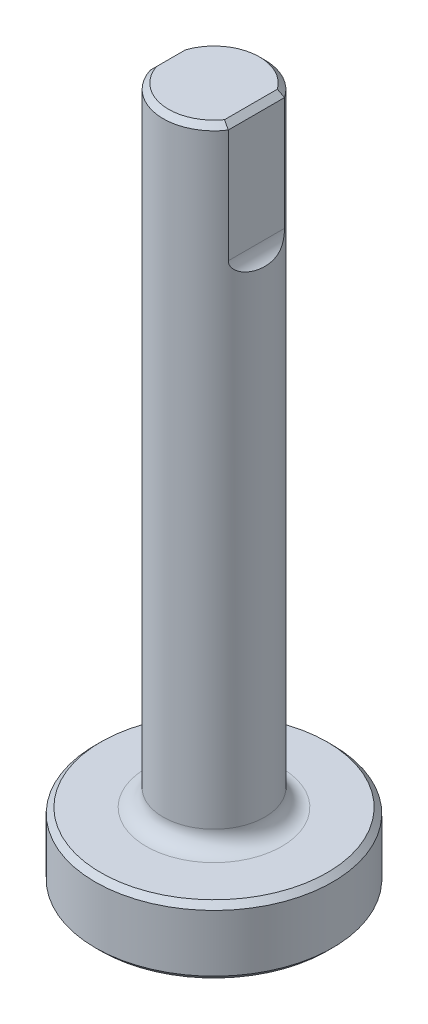
ISO-10303-21;
HEADER;
FILE_DESCRIPTION(('STEP AP214'),'2;1');
FILE_NAME('part.step','',(''),(''),'','','');
FILE_SCHEMA(('AUTOMOTIVE_DESIGN { 1 0 10303 214 1 1 1 1 }'));
ENDSEC;
DATA;
#1=APPLICATION_CONTEXT('core data for automotive mechanical design processes');
#2=APPLICATION_PROTOCOL_DEFINITION('international standard','automotive_design',2000,#1);
#3=PRODUCT_CONTEXT('',#1,'mechanical');
#4=PRODUCT('Part','Part','',(#3));
#5=PRODUCT_RELATED_PRODUCT_CATEGORY('part','',(#4));
#6=PRODUCT_DEFINITION_FORMATION('','',#4);
#7=PRODUCT_DEFINITION_CONTEXT('part definition',#1,'design');
#8=PRODUCT_DEFINITION('design','',#6,#7);
#9=PRODUCT_DEFINITION_SHAPE('','',#8);
#10=(LENGTH_UNIT() NAMED_UNIT(*) SI_UNIT(.MILLI.,.METRE.));
#11=(NAMED_UNIT(*) PLANE_ANGLE_UNIT() SI_UNIT($,.RADIAN.));
#12=(NAMED_UNIT(*) SI_UNIT($,.STERADIAN.) SOLID_ANGLE_UNIT());
#13=UNCERTAINTY_MEASURE_WITH_UNIT(LENGTH_MEASURE(1.E-05),#10,'distance_accuracy_value','');
#14=(GEOMETRIC_REPRESENTATION_CONTEXT(3) GLOBAL_UNCERTAINTY_ASSIGNED_CONTEXT((#13)) GLOBAL_UNIT_ASSIGNED_CONTEXT((#10,
#11,#12)) REPRESENTATION_CONTEXT('',''));
#15=CARTESIAN_POINT('',(0.,0.,0.));
#16=DIRECTION('',(0.,0.,1.));
#17=DIRECTION('',(1.,0.,0.));
#18=AXIS2_PLACEMENT_3D('',#15,#16,#17);
#19=CARTESIAN_POINT('',(0.,0.,0.));
#20=DIRECTION('',(0.,1.,0.));
#21=DIRECTION('',(0.,0.,1.));
#22=AXIS2_PLACEMENT_3D('',#19,#20,#21);
#23=PLANE('',#22);
#24=CARTESIAN_POINT('',(0.,0.,0.));
#25=DIRECTION('',(0.,1.,0.));
#26=DIRECTION('',(0.,0.,1.));
#27=AXIS2_PLACEMENT_3D('',#24,#25,#26);
#28=CIRCLE('',#27,5.30225);
#29=CARTESIAN_POINT('',(0.,0.,5.30225));
#30=VERTEX_POINT('',#29);
#31=EDGE_CURVE('E235',#30,#30,#28,.F.);
#32=ORIENTED_EDGE('',*,*,#31,.T.);
#33=EDGE_LOOP('',(#32));
#34=FACE_BOUND('',#33,.T.);
#35=ADVANCED_FACE('F32',(#34),#23,.F.);
#36=CARTESIAN_POINT('',(0.,3.46937086092716,0.));
#37=DIRECTION('',(0.,1.,0.));
#38=DIRECTION('',(0.,0.,1.));
#39=AXIS2_PLACEMENT_3D('',#36,#37,#38);
#40=CYLINDRICAL_SURFACE('',#39,5.55625);
#41=CARTESIAN_POINT('',(0.,0.254000000000003,0.));
#42=DIRECTION('',(0.,1.,0.));
#43=DIRECTION('',(0.,0.,1.));
#44=AXIS2_PLACEMENT_3D('',#41,#42,#43);
#45=CIRCLE('',#44,5.55625);
#46=CARTESIAN_POINT('',(0.,0.254000000000003,5.55625));
#47=VERTEX_POINT('',#46);
#48=EDGE_CURVE('E346',#47,#47,#45,.T.);
#49=ORIENTED_EDGE('',*,*,#48,.T.);
#50=EDGE_LOOP('',(#49));
#51=FACE_BOUND('',#50,.T.);
#52=CARTESIAN_POINT('',(0.,2.921,0.));
#53=DIRECTION('',(0.,-1.,0.));
#54=DIRECTION('',(0.,0.,-1.));
#55=AXIS2_PLACEMENT_3D('',#52,#53,#54);
#56=CIRCLE('',#55,5.55625);
#57=CARTESIAN_POINT('',(0.,2.921,-5.55625));
#58=VERTEX_POINT('',#57);
#59=EDGE_CURVE('E348',#58,#58,#56,.T.);
#60=ORIENTED_EDGE('',*,*,#59,.T.);
#61=EDGE_LOOP('',(#60));
#62=FACE_BOUND('',#61,.T.);
#63=ADVANCED_FACE('F184',(#51,#62),#40,.T.);
#64=CARTESIAN_POINT('',(5.55625,3.175,0.));
#65=DIRECTION('',(0.,-1.,0.));
#66=DIRECTION('',(0.,0.,-1.));
#67=AXIS2_PLACEMENT_3D('',#64,#65,#66);
#68=PLANE('',#67);
#69=CARTESIAN_POINT('',(0.,3.175,0.));
#70=DIRECTION('',(0.,-1.,0.));
#71=DIRECTION('',(0.,0.,-1.));
#72=AXIS2_PLACEMENT_3D('',#69,#70,#71);
#73=CIRCLE('',#72,5.30224999999999);
#74=CARTESIAN_POINT('',(0.,3.175,-5.30224999999999));
#75=VERTEX_POINT('',#74);
#76=EDGE_CURVE('E203',#75,#75,#73,.F.);
#77=ORIENTED_EDGE('',*,*,#76,.T.);
#78=EDGE_LOOP('',(#77));
#79=FACE_BOUND('',#78,.T.);
#80=CARTESIAN_POINT('',(0.,3.175,0.));
#81=DIRECTION('',(0.,-1.,0.));
#82=DIRECTION('',(0.,0.,-1.));
#83=AXIS2_PLACEMENT_3D('',#80,#81,#82);
#84=CIRCLE('',#83,3.175);
#85=CARTESIAN_POINT('',(0.,3.175,-3.175));
#86=VERTEX_POINT('',#85);
#87=EDGE_CURVE('E105',#86,#86,#84,.T.);
#88=ORIENTED_EDGE('',*,*,#87,.T.);
#89=EDGE_LOOP('',(#88));
#90=FACE_BOUND('',#89,.T.);
#91=ADVANCED_FACE('F189',(#79,#90),#68,.F.);
#92=CARTESIAN_POINT('',(0.,3.46937086092716,0.));
#93=DIRECTION('',(0.,1.,0.));
#94=DIRECTION('',(0.,0.,1.));
#95=AXIS2_PLACEMENT_3D('',#92,#93,#94);
#96=CYLINDRICAL_SURFACE('',#95,2.38125);
#97=CARTESIAN_POINT('',(0.,3.96875,0.));
#98=DIRECTION('',(0.,-1.,0.));
#99=DIRECTION('',(0.,0.,-1.));
#100=AXIS2_PLACEMENT_3D('',#97,#98,#99);
#101=CIRCLE('',#100,2.38125);
#102=CARTESIAN_POINT('',(0.,3.96875,-2.38125));
#103=VERTEX_POINT('',#102);
#104=EDGE_CURVE('E110',#103,#103,#101,.F.);
#105=ORIENTED_EDGE('',*,*,#104,.T.);
#106=EDGE_LOOP('',(#105));
#107=FACE_BOUND('',#106,.T.);
#108=DIRECTION('',(0.,1.,0.));
#109=VECTOR('',#108,1.);
#110=CARTESIAN_POINT('',(1.984375,26.19375,1.3162854636723));
#111=LINE('',#110,#109);
#112=CARTESIAN_POINT('',(1.984375,26.9875,1.3162854636723));
#113=VERTEX_POINT('',#112);
#114=CARTESIAN_POINT('',(1.984375,32.28975,1.3162854636723));
#115=VERTEX_POINT('',#114);
#116=EDGE_CURVE('E211',#113,#115,#111,.T.);
#117=ORIENTED_EDGE('',*,*,#116,.T.);
#118=CARTESIAN_POINT('',(0.,32.28975,0.));
#119=DIRECTION('',(0.,-1.,0.));
#120=DIRECTION('',(0.,0.,-1.));
#121=AXIS2_PLACEMENT_3D('',#118,#119,#120);
#122=CIRCLE('',#121,2.38125);
#123=CARTESIAN_POINT('',(-2.27039972918574,32.28975,0.718078430405285));
#124=VERTEX_POINT('',#123);
#125=EDGE_CURVE('E46',#115,#124,#122,.T.);
#126=ORIENTED_EDGE('',*,*,#125,.T.);
#127=DIRECTION('',(0.,1.,0.));
#128=VECTOR('',#127,1.);
#129=CARTESIAN_POINT('',(-2.27039972918574,26.19375,0.718078430405285));
#130=LINE('',#129,#128);
#131=CARTESIAN_POINT('',(-2.27039972918574,26.9875,0.718078430405285));
#132=VERTEX_POINT('',#131);
#133=EDGE_CURVE('E93',#132,#124,#130,.T.);
#134=ORIENTED_EDGE('',*,*,#133,.F.);
#135=CARTESIAN_POINT('',(-2.27039972918574,26.9875,0.718078430405285));
#136=CARTESIAN_POINT('',(-2.27038527391428,26.9727456678707,0.718111103304749));
#137=CARTESIAN_POINT('',(-2.27081052002696,26.9580297069355,0.716780032979917));
#138=CARTESIAN_POINT('',(-2.27241716558125,26.9291987032954,0.711676603800004));
#139=CARTESIAN_POINT('',(-2.2735918344916,26.9150794927074,0.707925971604035));
#140=CARTESIAN_POINT('',(-2.27657365298212,26.8877304723521,0.698274688896571));
#141=CARTESIAN_POINT('',(-2.27837896570396,26.87449821118,0.69238028047203));
#142=CARTESIAN_POINT('',(-2.2824621370443,26.8490449228022,0.678799758338327));
#143=CARTESIAN_POINT('',(-2.28474109091755,26.8368263329108,0.671109486661421));
#144=CARTESIAN_POINT('',(-2.29099462297106,26.8068907171461,0.649523607648366));
#145=CARTESIAN_POINT('',(-2.29519862316987,26.7899779931288,0.63458004071171));
#146=CARTESIAN_POINT('',(-2.30389447359601,26.7587777619404,0.602250163115962));
#147=CARTESIAN_POINT('',(-2.30838698295272,26.7444965769657,0.584858142325445));
#148=CARTESIAN_POINT('',(-2.31998829561007,26.7104500271335,0.537491110963838));
#149=CARTESIAN_POINT('',(-2.32705693871366,26.6925044092604,0.506205459331176));
#150=CARTESIAN_POINT('',(-2.3402669178886,26.6614428424115,0.44115631951765));
#151=CARTESIAN_POINT('',(-2.34640573622275,26.6483398728721,0.407386459055894));
#152=CARTESIAN_POINT('',(-2.36064718261604,26.6193561750505,0.317521113918822));
#153=CARTESIAN_POINT('',(-2.36769656115375,26.6065774978157,0.260260234412367));
#154=CARTESIAN_POINT('',(-2.37758990389766,26.5890436997704,0.144292111302181));
#155=CARTESIAN_POINT('',(-2.38043567179401,26.5842851375558,0.0855854990349644));
#156=CARTESIAN_POINT('',(-2.38144424257752,26.5825933376232,-0.00377127853161622));
#157=CARTESIAN_POINT('',(-2.38119799943706,26.5830023273933,-0.0343799667621086));
#158=CARTESIAN_POINT('',(-2.37953120859235,26.5858290412356,-0.0954801799063791));
#159=CARTESIAN_POINT('',(-2.37811046123916,26.5882471068224,-0.125971684015164));
#160=CARTESIAN_POINT('',(-2.37287553471448,26.5973398433244,-0.205530299470739));
#161=CARTESIAN_POINT('',(-2.36812230267266,26.6057266172491,-0.254354680013379));
#162=CARTESIAN_POINT('',(-2.35585853349066,26.6289724680028,-0.350137949887446));
#163=CARTESIAN_POINT('',(-2.34835064670659,26.6438253261247,-0.397098584429514));
#164=CARTESIAN_POINT('',(-2.33500848458042,26.6736096697082,-0.467732401173321));
#165=CARTESIAN_POINT('',(-2.32984947931918,26.6857430203094,-0.492712123503493));
#166=CARTESIAN_POINT('',(-2.31915808686494,26.713191233671,-0.540794002866291));
#167=CARTESIAN_POINT('',(-2.31362616978718,26.7285021394436,-0.563898445858658));
#168=CARTESIAN_POINT('',(-2.30403292351218,26.758498388342,-0.601717800141427));
#169=CARTESIAN_POINT('',(-2.29995386272613,26.7723607055767,-0.617075787255908));
#170=CARTESIAN_POINT('',(-2.29213693885591,26.8023653666847,-0.64550424098024));
#171=CARTESIAN_POINT('',(-2.2883985713271,26.8185042464398,-0.658578116757469));
#172=CARTESIAN_POINT('',(-2.28254302671655,26.8485771411343,-0.678548679715718));
#173=CARTESIAN_POINT('',(-2.2802569332023,26.8619957516393,-0.686167873149489));
#174=CARTESIAN_POINT('',(-2.2762937308763,26.8899303090729,-0.699202942082605));
#175=CARTESIAN_POINT('',(-2.27461501794256,26.9044432413622,-0.704624625940193));
#176=CARTESIAN_POINT('',(-2.27238029782344,26.9303823202084,-0.711793627657919));
#177=CARTESIAN_POINT('',(-2.27164595279296,26.9416314633334,-0.714129485073785));
#178=CARTESIAN_POINT('',(-2.27065173177812,26.9644145771418,-0.71728169828265));
#179=CARTESIAN_POINT('',(-2.2703941500313,26.9759496557684,-0.718090707076232));
#180=CARTESIAN_POINT('',(-2.27039972918574,26.9875,-0.718078430405286));
#181=B_SPLINE_CURVE_WITH_KNOTS('',3,(#135,#136,#137,#138,#139,#140,#141,#142,#143,#144,#145,
#146,#147,#148,#149,#150,#151,#152,#153,#154,#155,#156,#157,#158,#159,#160,#161,#162,#163,#164,
#165,#166,#167,#168,#169,#170,#171,#172,#173,#174,#175,#176,#177,#178,#179,#180),.UNSPECIFIED.,
.F.,.F.,(4,2,2,2,2,2,2,2,2,2,2,2,2,2,2,2,2,2,2,2,2,2,4),(0.,0.0441360269167635,
0.087881145540065,0.131499897003327,0.175220658309567,0.243698479080204,0.312338729864171,
0.421980102785481,0.531913245112246,0.708243009830831,0.884497092769059,0.976257914274412,
1.06803433701739,1.21689609029324,1.36561499210566,1.45017644887189,1.53463322698774,
1.59770753354464,1.66068687850792,1.70731522120568,1.75381950140364,1.7882483945014,
1.82284253676229),.UNSPECIFIED.);
#182=CARTESIAN_POINT('',(-2.27039972918574,26.9875,-0.718078430405285));
#183=VERTEX_POINT('',#182);
#184=EDGE_CURVE('E89',#132,#183,#181,.T.);
#185=ORIENTED_EDGE('',*,*,#184,.T.);
#186=DIRECTION('',(0.,1.,0.));
#187=VECTOR('',#186,1.);
#188=CARTESIAN_POINT('',(-2.27039972918574,26.19375,-0.718078430405285));
#189=LINE('',#188,#187);
#190=CARTESIAN_POINT('',(-2.27039972918574,32.28975,-0.718078430405285));
#191=VERTEX_POINT('',#190);
#192=EDGE_CURVE('E91',#183,#191,#189,.T.);
#193=ORIENTED_EDGE('',*,*,#192,.T.);
#194=CARTESIAN_POINT('',(0.,32.28975,0.));
#195=DIRECTION('',(0.,-1.,0.));
#196=DIRECTION('',(0.,0.,-1.));
#197=AXIS2_PLACEMENT_3D('',#194,#195,#196);
#198=CIRCLE('',#197,2.38125);
#199=CARTESIAN_POINT('',(1.984375,32.28975,-1.3162854636723));
#200=VERTEX_POINT('',#199);
#201=EDGE_CURVE('E226',#191,#200,#198,.T.);
#202=ORIENTED_EDGE('',*,*,#201,.T.);
#203=DIRECTION('',(0.,1.,0.));
#204=VECTOR('',#203,1.);
#205=CARTESIAN_POINT('',(1.984375,26.19375,-1.3162854636723));
#206=LINE('',#205,#204);
#207=CARTESIAN_POINT('',(1.984375,26.9875,-1.3162854636723));
#208=VERTEX_POINT('',#207);
#209=EDGE_CURVE('E102',#208,#200,#206,.T.);
#210=ORIENTED_EDGE('',*,*,#209,.F.);
#211=CARTESIAN_POINT('',(1.984375,26.9875,-1.3162854636723));
#212=CARTESIAN_POINT('',(1.98437254637529,26.9728349333905,-1.31628710255833));
#213=CARTESIAN_POINT('',(1.98478189032425,26.9581798400713,-1.31567222166397));
#214=CARTESIAN_POINT('',(1.98639756705435,26.9290270731987,-1.31323248750931));
#215=CARTESIAN_POINT('',(1.98760323305197,26.9145292782491,-1.31140864654169));
#216=CARTESIAN_POINT('',(1.99234222306236,26.8717451188891,-1.30420787427204));
#217=CARTESIAN_POINT('',(1.99699877068502,26.8438522958712,-1.29710050819205));
#218=CARTESIAN_POINT('',(2.00880252206822,26.7901711037092,-1.27874154243411));
#219=CARTESIAN_POINT('',(2.01594270152918,26.764377049972,-1.26750162553204));
#220=CARTESIAN_POINT('',(2.0320798846001,26.7152379236666,-1.24146616911219));
#221=CARTESIAN_POINT('',(2.04108123499204,26.6918987806243,-1.22666229238727));
#222=CARTESIAN_POINT('',(2.06371743510572,26.6400460692519,-1.18830696090758));
#223=CARTESIAN_POINT('',(2.07785745782244,26.6126711079488,-1.16352116731389));
#224=CARTESIAN_POINT('',(2.10696545221826,26.5627390008057,-1.10994831516191));
#225=CARTESIAN_POINT('',(2.121934753736,26.5401898928311,-1.08115471086299));
#226=CARTESIAN_POINT('',(2.15953116589563,26.488626206031,-1.00469204998818));
#227=CARTESIAN_POINT('',(2.18204253490515,26.4624540712155,-0.95506397244648));
#228=CARTESIAN_POINT('',(2.2245379362667,26.4178239447159,-0.851439543297286));
#229=CARTESIAN_POINT('',(2.24451463853857,26.3993879860442,-0.797431230903436));
#230=CARTESIAN_POINT('',(2.27720387813559,26.3714831613987,-0.69776165790149));
#231=CARTESIAN_POINT('',(2.29056979008435,26.3609574770958,-0.65259835348223));
#232=CARTESIAN_POINT('',(2.31471407720282,26.3428935680671,-0.560977664998594));
#233=CARTESIAN_POINT('',(2.32549078727777,26.3353572637705,-0.514519469515165));
#234=CARTESIAN_POINT('',(2.34426545922168,26.322720158223,-0.420778797486495));
#235=CARTESIAN_POINT('',(2.35226628866343,26.3176168415669,-0.373497224878809));
#236=CARTESIAN_POINT('',(2.36541145487309,26.3094392349712,-0.278363924628741));
#237=CARTESIAN_POINT('',(2.37055550943249,26.3063651454845,-0.230512141134449));
#238=CARTESIAN_POINT('',(2.37786794909575,26.3020432767619,-0.13538631552528));
#239=CARTESIAN_POINT('',(2.38008916589753,26.3007630442679,-0.0881177678440039));
#240=CARTESIAN_POINT('',(2.38171157420135,26.2998255822535,0.00650917327202727));
#241=CARTESIAN_POINT('',(2.38111115020477,26.3001692824981,0.0538676026547879));
#242=CARTESIAN_POINT('',(2.37675567638309,26.3027006117951,0.156302062280263));
#243=CARTESIAN_POINT('',(2.37249206757629,26.3051857027841,0.211350302892277));
#244=CARTESIAN_POINT('',(2.36017375638233,26.3126608952898,0.320890666672588));
#245=CARTESIAN_POINT('',(2.35211650977095,26.317652678083,0.375382391514957));
#246=CARTESIAN_POINT('',(2.33233502181064,26.3306507931142,0.483291063417509));
#247=CARTESIAN_POINT('',(2.32061404624806,26.338654441916,0.536708922745798));
#248=CARTESIAN_POINT('',(2.29373859983049,26.3584622994793,0.641915665185082));
#249=CARTESIAN_POINT('',(2.27858785077183,26.3702623943557,0.693706245261953));
#250=CARTESIAN_POINT('',(2.24640195498144,26.3978155548786,0.791516459387464));
#251=CARTESIAN_POINT('',(2.22956355745707,26.4132472946285,0.837689498546587));
#252=CARTESIAN_POINT('',(2.19390881476689,26.4495606832375,0.927048002091313));
#253=CARTESIAN_POINT('',(2.17509476616507,26.4704360452301,0.970236840631744));
#254=CARTESIAN_POINT('',(2.14016859944779,26.5145429660904,1.04470126131718));
#255=CARTESIAN_POINT('',(2.12419544438629,26.536636250995,1.07670748183885));
#256=CARTESIAN_POINT('',(2.09272938544516,26.5860936312752,1.13664998049081));
#257=CARTESIAN_POINT('',(2.07723560982936,26.6134474160094,1.16459403541145));
#258=CARTESIAN_POINT('',(2.05234128104965,26.6652401660992,1.20776018942865));
#259=CARTESIAN_POINT('',(2.04245849833513,26.6883073278602,1.2243431183112));
#260=CARTESIAN_POINT('',(2.02440124843836,26.737263037229,1.25397446663641));
#261=CARTESIAN_POINT('',(2.01622688173001,26.7631517506394,1.26702267821162));
#262=CARTESIAN_POINT('',(2.0022607384983,26.8175854072788,1.28898271148559));
#263=CARTESIAN_POINT('',(1.99649450504567,26.8461550755405,1.29785031066186));
#264=CARTESIAN_POINT('',(1.98814729150299,26.9047825337514,1.3106043996704));
#265=CARTESIAN_POINT('',(1.98555551833297,26.9348349178419,1.31450776949516));
#266=CARTESIAN_POINT('',(1.98447997482036,26.9724921109857,1.31612655160265));
#267=CARTESIAN_POINT('',(1.98437278693377,26.979998050983,1.31628772140429));
#268=CARTESIAN_POINT('',(1.984375,26.9875,1.3162854636723));
#269=B_SPLINE_CURVE_WITH_KNOTS('',3,(#211,#212,#213,#214,#215,#216,#217,#218,#219,#220,#221,
#222,#223,#224,#225,#226,#227,#228,#229,#230,#231,#232,#233,#234,#235,#236,#237,#238,#239,#240,
#241,#242,#243,#244,#245,#246,#247,#248,#249,#250,#251,#252,#253,#254,#255,#256,#257,#258,#259,
#260,#261,#262,#263,#264,#265,#266,#267,#268),.UNSPECIFIED.,.F.,.F.,(4,2,2,2,2,2,2,2,2,2,2,2,2,
2,2,2,2,2,2,2,2,2,2,2,2,2,2,2,4),(0.,0.0439577116843501,0.0878786628866886,0.174790009526513,
0.261457522485324,0.348329782080041,0.466300905046897,0.584467015454574,0.764819199486379,
0.945681605339596,1.09027576730072,1.23496266918272,1.37949965673383,1.52405091993385,
1.66595172749396,1.80793378865603,1.97355388731869,2.13928521857739,2.3048692389834,
2.47027443103756,2.62449282253584,2.77853388923391,2.90426244878843,3.02974704520628,
3.11966004994641,3.20957834108693,3.30042755447221,3.39096701777327,3.41348173763346),.UNSPECIFIED.);
#270=EDGE_CURVE('E97',#208,#113,#269,.T.);
#271=ORIENTED_EDGE('',*,*,#270,.T.);
#272=EDGE_LOOP('',(#117,#126,#134,#185,#193,#202,#210,#271));
#273=FACE_BOUND('',#272,.T.);
#274=ADVANCED_FACE('F90',(#107,#273),#96,.T.);
#275=CARTESIAN_POINT('',(2.38125,32.54375,0.));
#276=DIRECTION('',(0.,-1.,0.));
#277=DIRECTION('',(0.,0.,-1.));
#278=AXIS2_PLACEMENT_3D('',#275,#276,#277);
#279=PLANE('',#278);
#280=CARTESIAN_POINT('',(0.,32.54375,0.));
#281=DIRECTION('',(0.,-1.,0.));
#282=DIRECTION('',(0.,0.,-1.));
#283=AXIS2_PLACEMENT_3D('',#280,#281,#282);
#284=CIRCLE('',#283,2.12725);
#285=CARTESIAN_POINT('',(-2.01639972918574,32.54375,0.677734973747303));
#286=VERTEX_POINT('',#285);
#287=CARTESIAN_POINT('',(1.73037499999972,32.54375,1.23733379565741));
#288=VERTEX_POINT('',#287);
#289=EDGE_CURVE('E240',#286,#288,#284,.F.);
#290=ORIENTED_EDGE('',*,*,#289,.T.);
#291=DIRECTION('',(0.,0.,-1.));
#292=VECTOR('',#291,1.);
#293=CARTESIAN_POINT('',(1.730375,32.54375,0.));
#294=LINE('',#293,#292);
#295=CARTESIAN_POINT('',(1.73037499999972,32.54375,-1.23733379565741));
#296=VERTEX_POINT('',#295);
#297=EDGE_CURVE('E242',#288,#296,#294,.T.);
#298=ORIENTED_EDGE('',*,*,#297,.T.);
#299=CARTESIAN_POINT('',(0.,32.54375,0.));
#300=DIRECTION('',(0.,-1.,0.));
#301=DIRECTION('',(0.,0.,-1.));
#302=AXIS2_PLACEMENT_3D('',#299,#300,#301);
#303=CIRCLE('',#302,2.12725);
#304=CARTESIAN_POINT('',(-2.01639972918559,32.54375,-0.677734973747304));
#305=VERTEX_POINT('',#304);
#306=EDGE_CURVE('E227',#296,#305,#303,.F.);
#307=ORIENTED_EDGE('',*,*,#306,.T.);
#308=DIRECTION('',(0.,0.,1.));
#309=VECTOR('',#308,1.);
#310=CARTESIAN_POINT('',(-2.01639972918574,32.54375,0.));
#311=LINE('',#310,#309);
#312=EDGE_CURVE('E233',#305,#286,#311,.T.);
#313=ORIENTED_EDGE('',*,*,#312,.T.);
#314=EDGE_LOOP('',(#290,#298,#307,#313));
#315=FACE_BOUND('',#314,.T.);
#316=ADVANCED_FACE('F198',(#315),#279,.F.);
#317=CARTESIAN_POINT('',(-2.27039972918574,26.19375,0.718078430405285));
#318=DIRECTION('',(1.,0.,0.));
#319=DIRECTION('',(0.,0.,-1.));
#320=AXIS2_PLACEMENT_3D('',#317,#318,#319);
#321=PLANE('',#320);
#322=ORIENTED_EDGE('',*,*,#133,.T.);
#323=DIRECTION('',(0.,0.,-1.));
#324=VECTOR('',#323,1.);
#325=CARTESIAN_POINT('',(-2.27039972918574,32.28975,0.718078430405285));
#326=LINE('',#325,#324);
#327=EDGE_CURVE('E11',#124,#191,#326,.T.);
#328=ORIENTED_EDGE('',*,*,#327,.T.);
#329=ORIENTED_EDGE('',*,*,#192,.F.);
#330=DIRECTION('',(0.,0.,-1.));
#331=VECTOR('',#330,1.);
#332=CARTESIAN_POINT('',(-2.27039972918574,26.9875,0.718078430405285));
#333=LINE('',#332,#331);
#334=EDGE_CURVE('E101',#183,#132,#333,.F.);
#335=ORIENTED_EDGE('',*,*,#334,.T.);
#336=EDGE_LOOP('',(#322,#328,#329,#335));
#337=FACE_BOUND('',#336,.T.);
#338=ADVANCED_FACE('F100',(#337),#321,.F.);
#339=CARTESIAN_POINT('',(1.984375,26.19375,1.3162854636723));
#340=DIRECTION('',(-1.,0.,0.));
#341=DIRECTION('',(0.,0.,1.));
#342=AXIS2_PLACEMENT_3D('',#339,#340,#341);
#343=PLANE('',#342);
#344=ORIENTED_EDGE('',*,*,#209,.T.);
#345=DIRECTION('',(0.,0.,1.));
#346=VECTOR('',#345,1.);
#347=CARTESIAN_POINT('',(1.984375,32.28975,1.3162854636723));
#348=LINE('',#347,#346);
#349=EDGE_CURVE('E222',#200,#115,#348,.T.);
#350=ORIENTED_EDGE('',*,*,#349,.T.);
#351=ORIENTED_EDGE('',*,*,#116,.F.);
#352=DIRECTION('',(0.,0.,1.));
#353=VECTOR('',#352,1.);
#354=CARTESIAN_POINT('',(1.984375,26.9875,1.3162854636723));
#355=LINE('',#354,#353);
#356=EDGE_CURVE('E98',#113,#208,#355,.F.);
#357=ORIENTED_EDGE('',*,*,#356,.T.);
#358=EDGE_LOOP('',(#344,#350,#351,#357));
#359=FACE_BOUND('',#358,.T.);
#360=ADVANCED_FACE('F208',(#359),#343,.F.);
#361=CARTESIAN_POINT('',(0.,3.96875,0.));
#362=DIRECTION('',(0.,-1.,0.));
#363=DIRECTION('',(0.,0.,-1.));
#364=AXIS2_PLACEMENT_3D('',#361,#362,#363);
#365=TOROIDAL_SURFACE('',#364,3.175,0.79375);
#366=ORIENTED_EDGE('',*,*,#87,.F.);
#367=EDGE_LOOP('',(#366));
#368=FACE_BOUND('',#367,.T.);
#369=ORIENTED_EDGE('',*,*,#104,.F.);
#370=EDGE_LOOP('',(#369));
#371=FACE_BOUND('',#370,.T.);
#372=ADVANCED_FACE('F133',(#368,#371),#365,.F.);
#373=CARTESIAN_POINT('',(-3.06414972918574,26.9875,0.));
#374=DIRECTION('',(0.,0.,-1.));
#375=DIRECTION('',(-1.,0.,0.));
#376=AXIS2_PLACEMENT_3D('',#373,#374,#375);
#377=CYLINDRICAL_SURFACE('',#376,0.79375);
#378=ORIENTED_EDGE('',*,*,#184,.F.);
#379=ORIENTED_EDGE('',*,*,#334,.F.);
#380=EDGE_LOOP('',(#378,#379));
#381=FACE_BOUND('',#380,.T.);
#382=ADVANCED_FACE('F104',(#381),#377,.F.);
#383=CARTESIAN_POINT('',(2.778125,26.9875,0.));
#384=DIRECTION('',(0.,0.,1.));
#385=DIRECTION('',(1.,0.,0.));
#386=AXIS2_PLACEMENT_3D('',#383,#384,#385);
#387=CYLINDRICAL_SURFACE('',#386,0.79375);
#388=ORIENTED_EDGE('',*,*,#270,.F.);
#389=ORIENTED_EDGE('',*,*,#356,.F.);
#390=EDGE_LOOP('',(#388,#389));
#391=FACE_BOUND('',#390,.T.);
#392=ADVANCED_FACE('F132',(#391),#387,.F.);
#393=CARTESIAN_POINT('',(0.,0.254000000000003,0.));
#394=DIRECTION('',(0.,1.,0.));
#395=DIRECTION('',(0.,0.,1.));
#396=AXIS2_PLACEMENT_3D('',#393,#394,#395);
#397=CONICAL_SURFACE('',#396,5.55625,0.785398163397445);
#398=ORIENTED_EDGE('',*,*,#31,.F.);
#399=EDGE_LOOP('',(#398));
#400=FACE_BOUND('',#399,.T.);
#401=ORIENTED_EDGE('',*,*,#48,.F.);
#402=EDGE_LOOP('',(#401));
#403=FACE_BOUND('',#402,.T.);
#404=ADVANCED_FACE('F138',(#400,#403),#397,.T.);
#405=CARTESIAN_POINT('',(0.,3.175,0.));
#406=DIRECTION('',(0.,-1.,0.));
#407=DIRECTION('',(0.,0.,-1.));
#408=AXIS2_PLACEMENT_3D('',#405,#406,#407);
#409=CONICAL_SURFACE('',#408,5.30224999999999,0.785398163397452);
#410=ORIENTED_EDGE('',*,*,#59,.F.);
#411=EDGE_LOOP('',(#410));
#412=FACE_BOUND('',#411,.T.);
#413=ORIENTED_EDGE('',*,*,#76,.F.);
#414=EDGE_LOOP('',(#413));
#415=FACE_BOUND('',#414,.T.);
#416=ADVANCED_FACE('F142',(#412,#415),#409,.T.);
#417=CARTESIAN_POINT('',(-2.27039972918574,32.28975,0.718078430405285));
#418=DIRECTION('',(0.707106781186543,-0.707106781186552,0.));
#419=DIRECTION('',(0.,0.,-1.));
#420=AXIS2_PLACEMENT_3D('',#417,#418,#419);
#421=PLANE('',#420);
#422=CARTESIAN_POINT('',(-2.27039972918574,32.28975,0.718078430405285));
#423=CARTESIAN_POINT('',(-2.2280511633951,32.3320985657906,0.711546404372671));
#424=CARTESIAN_POINT('',(-2.18571021689547,32.3744395122903,0.704918437135333));
#425=CARTESIAN_POINT('',(-2.10104355022436,32.4591061789614,0.691470618304908));
#426=CARTESIAN_POINT('',(-2.05871783005731,32.5014318991284,0.684650766656277));
#427=CARTESIAN_POINT('',(-2.01639972918566,32.5437500000001,0.677734973747381));
#428=B_SPLINE_CURVE_WITH_KNOTS('',3,(#422,#423,#424,#425,#426,#427),.UNSPECIFIED.,.F.,.F.,(4,2,
4),(0.,0.180734537529557,0.361469127374622),.UNSPECIFIED.);
#429=EDGE_CURVE('E163',#286,#124,#428,.F.);
#430=ORIENTED_EDGE('',*,*,#429,.F.);
#431=ORIENTED_EDGE('',*,*,#312,.F.);
#432=CARTESIAN_POINT('',(-2.27039972918574,32.28975,-0.718078430405285));
#433=CARTESIAN_POINT('',(-2.22805116339512,32.3320985657906,-0.711546404372673));
#434=CARTESIAN_POINT('',(-2.1857102168955,32.3744395122902,-0.704918437135338));
#435=CARTESIAN_POINT('',(-2.10104355022442,32.4591061789613,-0.691470618304916));
#436=CARTESIAN_POINT('',(-2.05871783005737,32.5014318991284,-0.684650766656287));
#437=CARTESIAN_POINT('',(-2.01639972918573,32.54375,-0.677734973747393));
#438=B_SPLINE_CURVE_WITH_KNOTS('',3,(#432,#433,#434,#435,#436,#437),.UNSPECIFIED.,.F.,.F.,(4,2,
4),(0.,0.180734537529498,0.361469127374513),.UNSPECIFIED.);
#439=EDGE_CURVE('E37',#191,#305,#438,.T.);
#440=ORIENTED_EDGE('',*,*,#439,.F.);
#441=ORIENTED_EDGE('',*,*,#327,.F.);
#442=EDGE_LOOP('',(#430,#431,#440,#441));
#443=FACE_BOUND('',#442,.T.);
#444=ADVANCED_FACE('F34',(#443),#421,.F.);
#445=CARTESIAN_POINT('',(0.,32.54375,0.));
#446=DIRECTION('',(0.,-1.,0.));
#447=DIRECTION('',(0.,0.,-1.));
#448=AXIS2_PLACEMENT_3D('',#445,#446,#447);
#449=CONICAL_SURFACE('',#448,2.12725,0.785398163397454);
#450=ORIENTED_EDGE('',*,*,#439,.T.);
#451=ORIENTED_EDGE('',*,*,#306,.F.);
#452=CARTESIAN_POINT('',(1.730375,32.54375,-1.23733379565761));
#453=CARTESIAN_POINT('',(1.77264805669818,32.5014769433018,-1.25088041492007));
#454=CARTESIAN_POINT('',(1.81495126425857,32.4591737357414,-1.2642330339982));
#455=CARTESIAN_POINT('',(1.89961793099656,32.3745070690034,-1.29055025621083));
#456=CARTESIAN_POINT('',(1.94198139010278,32.3321436098972,-1.30351485980458));
#457=CARTESIAN_POINT('',(1.98437499999984,32.2897500000002,-1.31628546367326));
#458=B_SPLINE_CURVE_WITH_KNOTS('',3,(#452,#453,#454,#455,#456,#457),.UNSPECIFIED.,.F.,.F.,(4,2,
4),(0.,0.18389327498409,0.367786332305683),.UNSPECIFIED.);
#459=EDGE_CURVE('E169',#200,#296,#458,.F.);
#460=ORIENTED_EDGE('',*,*,#459,.F.);
#461=ORIENTED_EDGE('',*,*,#201,.F.);
#462=EDGE_LOOP('',(#450,#451,#460,#461));
#463=FACE_BOUND('',#462,.T.);
#464=ADVANCED_FACE('F152',(#463),#449,.T.);
#465=CARTESIAN_POINT('',(0.,32.54375,0.));
#466=DIRECTION('',(0.,-1.,0.));
#467=DIRECTION('',(0.,0.,-1.));
#468=AXIS2_PLACEMENT_3D('',#465,#466,#467);
#469=CONICAL_SURFACE('',#468,2.12725,0.785398163397454);
#470=ORIENTED_EDGE('',*,*,#429,.T.);
#471=ORIENTED_EDGE('',*,*,#125,.F.);
#472=CARTESIAN_POINT('',(1.984375,32.28975,1.3162854636723));
#473=CARTESIAN_POINT('',(1.94198139010287,32.3321436098971,1.30351485980406));
#474=CARTESIAN_POINT('',(1.8996179309966,32.3745070690034,1.29055025621064));
#475=CARTESIAN_POINT('',(1.81495126425854,32.4591737357414,1.2642330339984));
#476=CARTESIAN_POINT('',(1.77264805669813,32.5014769433019,1.25088041492034));
#477=CARTESIAN_POINT('',(1.73037499999996,32.54375,1.23733379565785));
#478=B_SPLINE_CURVE_WITH_KNOTS('',3,(#472,#473,#474,#475,#476,#477),.UNSPECIFIED.,.F.,.F.,(4,2,
4),(0.,0.1838930573216,0.367786332305697),.UNSPECIFIED.);
#479=EDGE_CURVE('E157',#288,#115,#478,.F.);
#480=ORIENTED_EDGE('',*,*,#479,.F.);
#481=ORIENTED_EDGE('',*,*,#289,.F.);
#482=EDGE_LOOP('',(#470,#471,#480,#481));
#483=FACE_BOUND('',#482,.T.);
#484=ADVANCED_FACE('F147',(#483),#469,.T.);
#485=CARTESIAN_POINT('',(1.984375,32.28975,1.3162854636723));
#486=DIRECTION('',(-0.707106781186543,-0.707106781186552,0.));
#487=DIRECTION('',(0.,0.,1.));
#488=AXIS2_PLACEMENT_3D('',#485,#486,#487);
#489=PLANE('',#488);
#490=ORIENTED_EDGE('',*,*,#459,.T.);
#491=ORIENTED_EDGE('',*,*,#297,.F.);
#492=ORIENTED_EDGE('',*,*,#479,.T.);
#493=ORIENTED_EDGE('',*,*,#349,.F.);
#494=EDGE_LOOP('',(#490,#491,#492,#493));
#495=FACE_BOUND('',#494,.T.);
#496=ADVANCED_FACE('F151',(#495),#489,.F.);
#497=CLOSED_SHELL('',(#35,#63,#91,#274,#316,#338,#360,#372,#382,#392,#404,#416,#444,#464,#484,#496));
#498=MANIFOLD_SOLID_BREP('B2',#497);
#499=ADVANCED_BREP_SHAPE_REPRESENTATION('',(#18,#498),#14);
#500=SHAPE_DEFINITION_REPRESENTATION(#9,#499);
ENDSEC;
END-ISO-10303-21;
